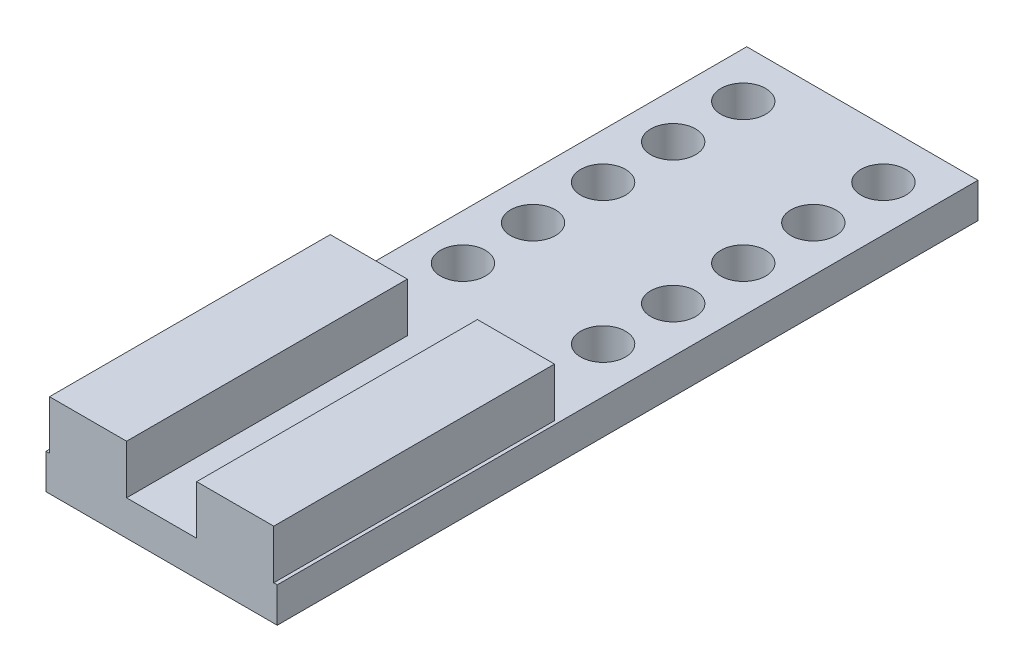
ISO-10303-21;
HEADER;
FILE_DESCRIPTION(('STEP AP214'),'2;1');
FILE_NAME('part.step','',(''),(''),'','','');
FILE_SCHEMA(('AUTOMOTIVE_DESIGN { 1 0 10303 214 1 1 1 1 }'));
ENDSEC;
DATA;
#1=APPLICATION_CONTEXT('core data for automotive mechanical design processes');
#2=APPLICATION_PROTOCOL_DEFINITION('international standard','automotive_design',2000,#1);
#3=PRODUCT_CONTEXT('',#1,'mechanical');
#4=PRODUCT('Part','Part','',(#3));
#5=PRODUCT_RELATED_PRODUCT_CATEGORY('part','',(#4));
#6=PRODUCT_DEFINITION_FORMATION('','',#4);
#7=PRODUCT_DEFINITION_CONTEXT('part definition',#1,'design');
#8=PRODUCT_DEFINITION('design','',#6,#7);
#9=PRODUCT_DEFINITION_SHAPE('','',#8);
#10=(LENGTH_UNIT() NAMED_UNIT(*) SI_UNIT(.MILLI.,.METRE.));
#11=(NAMED_UNIT(*) PLANE_ANGLE_UNIT() SI_UNIT($,.RADIAN.));
#12=(NAMED_UNIT(*) SI_UNIT($,.STERADIAN.) SOLID_ANGLE_UNIT());
#13=UNCERTAINTY_MEASURE_WITH_UNIT(LENGTH_MEASURE(1.E-05),#10,'distance_accuracy_value','');
#14=(GEOMETRIC_REPRESENTATION_CONTEXT(3) GLOBAL_UNCERTAINTY_ASSIGNED_CONTEXT((#13)) GLOBAL_UNIT_ASSIGNED_CONTEXT((#10,
#11,#12)) REPRESENTATION_CONTEXT('',''));
#15=CARTESIAN_POINT('',(0.,0.,0.));
#16=DIRECTION('',(0.,0.,1.));
#17=DIRECTION('',(1.,0.,0.));
#18=AXIS2_PLACEMENT_3D('',#15,#16,#17);
#19=CARTESIAN_POINT('',(5.,-2.5,-1.5));
#20=DIRECTION('',(0.,1.,0.));
#21=DIRECTION('',(0.,0.,1.));
#22=AXIS2_PLACEMENT_3D('',#19,#20,#21);
#23=CYLINDRICAL_SURFACE('',#22,1.6);
#24=CARTESIAN_POINT('',(5.,-2.5,-1.5));
#25=DIRECTION('',(0.,1.,0.));
#26=DIRECTION('',(0.,0.,-1.));
#27=AXIS2_PLACEMENT_3D('',#24,#25,#26);
#28=CIRCLE('',#27,1.6);
#29=CARTESIAN_POINT('',(5.,-2.5,-3.1));
#30=VERTEX_POINT('',#29);
#31=EDGE_CURVE('E42',#30,#30,#28,.T.);
#32=ORIENTED_EDGE('',*,*,#31,.F.);
#33=EDGE_LOOP('',(#32));
#34=FACE_BOUND('',#33,.T.);
#35=CARTESIAN_POINT('',(5.,0.,-1.5));
#36=DIRECTION('',(0.,1.,0.));
#37=DIRECTION('',(0.,0.,-1.));
#38=AXIS2_PLACEMENT_3D('',#35,#36,#37);
#39=CIRCLE('',#38,1.6);
#40=CARTESIAN_POINT('',(5.,0.,-3.1));
#41=VERTEX_POINT('',#40);
#42=EDGE_CURVE('E11',#41,#41,#39,.T.);
#43=ORIENTED_EDGE('',*,*,#42,.T.);
#44=EDGE_LOOP('',(#43));
#45=FACE_BOUND('',#44,.T.);
#46=ADVANCED_FACE('F35',(#34,#45),#23,.F.);
#47=CARTESIAN_POINT('',(5.,-2.5,-6.5));
#48=DIRECTION('',(0.,1.,0.));
#49=DIRECTION('',(0.,0.,1.));
#50=AXIS2_PLACEMENT_3D('',#47,#48,#49);
#51=CYLINDRICAL_SURFACE('',#50,1.6);
#52=CARTESIAN_POINT('',(5.,-2.5,-6.5));
#53=DIRECTION('',(0.,1.,0.));
#54=DIRECTION('',(0.,0.,-1.));
#55=AXIS2_PLACEMENT_3D('',#52,#53,#54);
#56=CIRCLE('',#55,1.6);
#57=CARTESIAN_POINT('',(5.,-2.5,-8.1));
#58=VERTEX_POINT('',#57);
#59=EDGE_CURVE('E239',#58,#58,#56,.T.);
#60=ORIENTED_EDGE('',*,*,#59,.F.);
#61=EDGE_LOOP('',(#60));
#62=FACE_BOUND('',#61,.T.);
#63=CARTESIAN_POINT('',(5.,0.,-6.5));
#64=DIRECTION('',(0.,1.,0.));
#65=DIRECTION('',(0.,0.,-1.));
#66=AXIS2_PLACEMENT_3D('',#63,#64,#65);
#67=CIRCLE('',#66,1.6);
#68=CARTESIAN_POINT('',(5.,0.,-8.1));
#69=VERTEX_POINT('',#68);
#70=EDGE_CURVE('E242',#69,#69,#67,.T.);
#71=ORIENTED_EDGE('',*,*,#70,.T.);
#72=EDGE_LOOP('',(#71));
#73=FACE_BOUND('',#72,.T.);
#74=ADVANCED_FACE('F251',(#62,#73),#51,.F.);
#75=CARTESIAN_POINT('',(5.,-2.5,-11.5));
#76=DIRECTION('',(0.,1.,0.));
#77=DIRECTION('',(0.,0.,1.));
#78=AXIS2_PLACEMENT_3D('',#75,#76,#77);
#79=CYLINDRICAL_SURFACE('',#78,1.6);
#80=CARTESIAN_POINT('',(5.,-2.5,-11.5));
#81=DIRECTION('',(0.,1.,0.));
#82=DIRECTION('',(0.,0.,-1.));
#83=AXIS2_PLACEMENT_3D('',#80,#81,#82);
#84=CIRCLE('',#83,1.6);
#85=CARTESIAN_POINT('',(5.,-2.5,-13.1));
#86=VERTEX_POINT('',#85);
#87=EDGE_CURVE('E233',#86,#86,#84,.T.);
#88=ORIENTED_EDGE('',*,*,#87,.F.);
#89=EDGE_LOOP('',(#88));
#90=FACE_BOUND('',#89,.T.);
#91=CARTESIAN_POINT('',(5.,0.,-11.5));
#92=DIRECTION('',(0.,1.,0.));
#93=DIRECTION('',(0.,0.,-1.));
#94=AXIS2_PLACEMENT_3D('',#91,#92,#93);
#95=CIRCLE('',#94,1.6);
#96=CARTESIAN_POINT('',(5.,0.,-13.1));
#97=VERTEX_POINT('',#96);
#98=EDGE_CURVE('E236',#97,#97,#95,.T.);
#99=ORIENTED_EDGE('',*,*,#98,.T.);
#100=EDGE_LOOP('',(#99));
#101=FACE_BOUND('',#100,.T.);
#102=ADVANCED_FACE('F290',(#90,#101),#79,.F.);
#103=CARTESIAN_POINT('',(-5.,-2.5,-1.5));
#104=DIRECTION('',(0.,1.,0.));
#105=DIRECTION('',(0.,0.,1.));
#106=AXIS2_PLACEMENT_3D('',#103,#104,#105);
#107=CYLINDRICAL_SURFACE('',#106,1.6);
#108=CARTESIAN_POINT('',(-5.,-2.5,-1.5));
#109=DIRECTION('',(0.,1.,0.));
#110=DIRECTION('',(0.,0.,1.));
#111=AXIS2_PLACEMENT_3D('',#108,#109,#110);
#112=CIRCLE('',#111,1.6);
#113=CARTESIAN_POINT('',(-5.,-2.5,0.0999999999999987));
#114=VERTEX_POINT('',#113);
#115=EDGE_CURVE('E227',#114,#114,#112,.T.);
#116=ORIENTED_EDGE('',*,*,#115,.F.);
#117=EDGE_LOOP('',(#116));
#118=FACE_BOUND('',#117,.T.);
#119=CARTESIAN_POINT('',(-5.,0.,-1.5));
#120=DIRECTION('',(0.,1.,0.));
#121=DIRECTION('',(0.,0.,1.));
#122=AXIS2_PLACEMENT_3D('',#119,#120,#121);
#123=CIRCLE('',#122,1.6);
#124=CARTESIAN_POINT('',(-5.,0.,0.0999999999999987));
#125=VERTEX_POINT('',#124);
#126=EDGE_CURVE('E230',#125,#125,#123,.T.);
#127=ORIENTED_EDGE('',*,*,#126,.T.);
#128=EDGE_LOOP('',(#127));
#129=FACE_BOUND('',#128,.T.);
#130=ADVANCED_FACE('F286',(#118,#129),#107,.F.);
#131=CARTESIAN_POINT('',(-5.,-2.5,-6.5));
#132=DIRECTION('',(0.,1.,0.));
#133=DIRECTION('',(0.,0.,1.));
#134=AXIS2_PLACEMENT_3D('',#131,#132,#133);
#135=CYLINDRICAL_SURFACE('',#134,1.6);
#136=CARTESIAN_POINT('',(-5.,-2.5,-6.5));
#137=DIRECTION('',(0.,1.,0.));
#138=DIRECTION('',(0.,0.,1.));
#139=AXIS2_PLACEMENT_3D('',#136,#137,#138);
#140=CIRCLE('',#139,1.6);
#141=CARTESIAN_POINT('',(-5.,-2.5,-4.9));
#142=VERTEX_POINT('',#141);
#143=EDGE_CURVE('E221',#142,#142,#140,.T.);
#144=ORIENTED_EDGE('',*,*,#143,.F.);
#145=EDGE_LOOP('',(#144));
#146=FACE_BOUND('',#145,.T.);
#147=CARTESIAN_POINT('',(-5.,0.,-6.5));
#148=DIRECTION('',(0.,1.,0.));
#149=DIRECTION('',(0.,0.,1.));
#150=AXIS2_PLACEMENT_3D('',#147,#148,#149);
#151=CIRCLE('',#150,1.6);
#152=CARTESIAN_POINT('',(-5.,0.,-4.9));
#153=VERTEX_POINT('',#152);
#154=EDGE_CURVE('E224',#153,#153,#151,.T.);
#155=ORIENTED_EDGE('',*,*,#154,.T.);
#156=EDGE_LOOP('',(#155));
#157=FACE_BOUND('',#156,.T.);
#158=ADVANCED_FACE('F267',(#146,#157),#135,.F.);
#159=CARTESIAN_POINT('',(-5.,-2.5,-11.5));
#160=DIRECTION('',(0.,1.,0.));
#161=DIRECTION('',(0.,0.,1.));
#162=AXIS2_PLACEMENT_3D('',#159,#160,#161);
#163=CYLINDRICAL_SURFACE('',#162,1.6);
#164=CARTESIAN_POINT('',(-5.,-2.5,-11.5));
#165=DIRECTION('',(0.,1.,0.));
#166=DIRECTION('',(0.,0.,1.));
#167=AXIS2_PLACEMENT_3D('',#164,#165,#166);
#168=CIRCLE('',#167,1.6);
#169=CARTESIAN_POINT('',(-5.,-2.5,-9.9));
#170=VERTEX_POINT('',#169);
#171=EDGE_CURVE('E209',#170,#170,#168,.T.);
#172=ORIENTED_EDGE('',*,*,#171,.F.);
#173=EDGE_LOOP('',(#172));
#174=FACE_BOUND('',#173,.T.);
#175=CARTESIAN_POINT('',(-5.,0.,-11.5));
#176=DIRECTION('',(0.,1.,0.));
#177=DIRECTION('',(0.,0.,1.));
#178=AXIS2_PLACEMENT_3D('',#175,#176,#177);
#179=CIRCLE('',#178,1.6);
#180=CARTESIAN_POINT('',(-5.,0.,-9.9));
#181=VERTEX_POINT('',#180);
#182=EDGE_CURVE('E218',#181,#181,#179,.T.);
#183=ORIENTED_EDGE('',*,*,#182,.T.);
#184=EDGE_LOOP('',(#183));
#185=FACE_BOUND('',#184,.T.);
#186=ADVANCED_FACE('F257',(#174,#185),#163,.F.);
#187=CARTESIAN_POINT('',(0.,0.,0.));
#188=DIRECTION('',(0.,1.,0.));
#189=DIRECTION('',(0.,0.,1.));
#190=AXIS2_PLACEMENT_3D('',#187,#188,#189);
#191=PLANE('',#190);
#192=CARTESIAN_POINT('',(5.,0.,-16.5));
#193=DIRECTION('',(0.,1.,0.));
#194=DIRECTION('',(0.,0.,-1.));
#195=AXIS2_PLACEMENT_3D('',#192,#193,#194);
#196=CIRCLE('',#195,1.6);
#197=CARTESIAN_POINT('',(5.,0.,-18.1));
#198=VERTEX_POINT('',#197);
#199=EDGE_CURVE('E408',#198,#198,#196,.T.);
#200=ORIENTED_EDGE('',*,*,#199,.F.);
#201=EDGE_LOOP('',(#200));
#202=FACE_BOUND('',#201,.T.);
#203=CARTESIAN_POINT('',(-5.,0.,-16.5));
#204=DIRECTION('',(0.,1.,0.));
#205=DIRECTION('',(0.,0.,1.));
#206=AXIS2_PLACEMENT_3D('',#203,#204,#205);
#207=CIRCLE('',#206,1.6);
#208=CARTESIAN_POINT('',(-5.,0.,-14.9));
#209=VERTEX_POINT('',#208);
#210=EDGE_CURVE('E410',#209,#209,#207,.T.);
#211=ORIENTED_EDGE('',*,*,#210,.F.);
#212=EDGE_LOOP('',(#211));
#213=FACE_BOUND('',#212,.T.);
#214=CARTESIAN_POINT('',(-5.,0.,-21.5));
#215=DIRECTION('',(0.,1.,0.));
#216=DIRECTION('',(0.,0.,1.));
#217=AXIS2_PLACEMENT_3D('',#214,#215,#216);
#218=CIRCLE('',#217,1.6);
#219=CARTESIAN_POINT('',(-5.,0.,-19.9));
#220=VERTEX_POINT('',#219);
#221=EDGE_CURVE('E418',#220,#220,#218,.T.);
#222=ORIENTED_EDGE('',*,*,#221,.F.);
#223=EDGE_LOOP('',(#222));
#224=FACE_BOUND('',#223,.T.);
#225=CARTESIAN_POINT('',(5.,0.,-21.5));
#226=DIRECTION('',(0.,1.,0.));
#227=DIRECTION('',(0.,0.,-1.));
#228=AXIS2_PLACEMENT_3D('',#225,#226,#227);
#229=CIRCLE('',#228,1.6);
#230=CARTESIAN_POINT('',(5.,0.,-23.1));
#231=VERTEX_POINT('',#230);
#232=EDGE_CURVE('E416',#231,#231,#229,.T.);
#233=ORIENTED_EDGE('',*,*,#232,.F.);
#234=EDGE_LOOP('',(#233));
#235=FACE_BOUND('',#234,.T.);
#236=DIRECTION('',(1.,0.,0.));
#237=VECTOR('',#236,1.);
#238=CARTESIAN_POINT('',(-8.25,0.,25.));
#239=LINE('',#238,#237);
#240=CARTESIAN_POINT('',(-2.5,0.,25.));
#241=VERTEX_POINT('',#240);
#242=CARTESIAN_POINT('',(2.5,0.,25.));
#243=VERTEX_POINT('',#242);
#244=EDGE_CURVE('E202',#241,#243,#239,.T.);
#245=ORIENTED_EDGE('',*,*,#244,.T.);
#246=DIRECTION('',(0.,0.,1.));
#247=VECTOR('',#246,1.);
#248=CARTESIAN_POINT('',(2.5,0.,25.));
#249=LINE('',#248,#247);
#250=CARTESIAN_POINT('',(2.5,0.,4.96735752453774));
#251=VERTEX_POINT('',#250);
#252=EDGE_CURVE('E148',#251,#243,#249,.T.);
#253=ORIENTED_EDGE('',*,*,#252,.F.);
#254=DIRECTION('',(-1.,0.,0.));
#255=VECTOR('',#254,1.);
#256=CARTESIAN_POINT('',(2.5,0.,4.96735752453774));
#257=LINE('',#256,#255);
#258=CARTESIAN_POINT('',(8.,0.,4.96735752453774));
#259=VERTEX_POINT('',#258);
#260=EDGE_CURVE('E144',#259,#251,#257,.T.);
#261=ORIENTED_EDGE('',*,*,#260,.F.);
#262=DIRECTION('',(0.,0.,-1.));
#263=VECTOR('',#262,1.);
#264=CARTESIAN_POINT('',(8.,0.,4.96735752453774));
#265=LINE('',#264,#263);
#266=CARTESIAN_POINT('',(8.,0.,25.));
#267=VERTEX_POINT('',#266);
#268=EDGE_CURVE('E356',#267,#259,#265,.T.);
#269=ORIENTED_EDGE('',*,*,#268,.F.);
#270=CARTESIAN_POINT('',(8.25,0.,25.));
#271=VERTEX_POINT('',#270);
#272=EDGE_CURVE('E198',#267,#271,#239,.T.);
#273=ORIENTED_EDGE('',*,*,#272,.T.);
#274=DIRECTION('',(0.,0.,-1.));
#275=VECTOR('',#274,1.);
#276=CARTESIAN_POINT('',(8.25,0.,-25.));
#277=LINE('',#276,#275);
#278=CARTESIAN_POINT('',(8.25,0.,-25.));
#279=VERTEX_POINT('',#278);
#280=EDGE_CURVE('E201',#271,#279,#277,.T.);
#281=ORIENTED_EDGE('',*,*,#280,.T.);
#282=DIRECTION('',(-1.,0.,0.));
#283=VECTOR('',#282,1.);
#284=CARTESIAN_POINT('',(-8.25,0.,-25.));
#285=LINE('',#284,#283);
#286=CARTESIAN_POINT('',(-8.25,0.,-25.));
#287=VERTEX_POINT('',#286);
#288=EDGE_CURVE('E186',#279,#287,#285,.T.);
#289=ORIENTED_EDGE('',*,*,#288,.T.);
#290=DIRECTION('',(0.,0.,1.));
#291=VECTOR('',#290,1.);
#292=CARTESIAN_POINT('',(-8.25,0.,-25.));
#293=LINE('',#292,#291);
#294=CARTESIAN_POINT('',(-8.25,0.,25.));
#295=VERTEX_POINT('',#294);
#296=EDGE_CURVE('E181',#287,#295,#293,.T.);
#297=ORIENTED_EDGE('',*,*,#296,.T.);
#298=CARTESIAN_POINT('',(-8.,0.,25.));
#299=VERTEX_POINT('',#298);
#300=EDGE_CURVE('E199',#295,#299,#239,.T.);
#301=ORIENTED_EDGE('',*,*,#300,.T.);
#302=DIRECTION('',(0.,0.,1.));
#303=VECTOR('',#302,1.);
#304=CARTESIAN_POINT('',(-8.,0.,25.));
#305=LINE('',#304,#303);
#306=CARTESIAN_POINT('',(-8.,0.,4.96735752453774));
#307=VERTEX_POINT('',#306);
#308=EDGE_CURVE('E57',#307,#299,#305,.T.);
#309=ORIENTED_EDGE('',*,*,#308,.F.);
#310=DIRECTION('',(-1.,0.,0.));
#311=VECTOR('',#310,1.);
#312=CARTESIAN_POINT('',(-8.,0.,4.96735752453774));
#313=LINE('',#312,#311);
#314=CARTESIAN_POINT('',(-2.5,0.,4.96735752453774));
#315=VERTEX_POINT('',#314);
#316=EDGE_CURVE('E160',#315,#307,#313,.T.);
#317=ORIENTED_EDGE('',*,*,#316,.F.);
#318=DIRECTION('',(0.,0.,-1.));
#319=VECTOR('',#318,1.);
#320=CARTESIAN_POINT('',(-2.5,0.,4.96735752453774));
#321=LINE('',#320,#319);
#322=EDGE_CURVE('E151',#241,#315,#321,.T.);
#323=ORIENTED_EDGE('',*,*,#322,.F.);
#324=EDGE_LOOP('',(#245,#253,#261,#269,#273,#281,#289,#297,#301,#309,#317,#323));
#325=FACE_BOUND('',#324,.T.);
#326=ORIENTED_EDGE('',*,*,#182,.F.);
#327=EDGE_LOOP('',(#326));
#328=FACE_BOUND('',#327,.T.);
#329=ORIENTED_EDGE('',*,*,#154,.F.);
#330=EDGE_LOOP('',(#329));
#331=FACE_BOUND('',#330,.T.);
#332=ORIENTED_EDGE('',*,*,#126,.F.);
#333=EDGE_LOOP('',(#332));
#334=FACE_BOUND('',#333,.T.);
#335=ORIENTED_EDGE('',*,*,#98,.F.);
#336=EDGE_LOOP('',(#335));
#337=FACE_BOUND('',#336,.T.);
#338=ORIENTED_EDGE('',*,*,#70,.F.);
#339=EDGE_LOOP('',(#338));
#340=FACE_BOUND('',#339,.T.);
#341=ORIENTED_EDGE('',*,*,#42,.F.);
#342=EDGE_LOOP('',(#341));
#343=FACE_BOUND('',#342,.T.);
#344=ADVANCED_FACE('F254',(#202,#213,#224,#235,#325,#328,#331,#334,#337,#340,#343),#191,.T.);
#345=CARTESIAN_POINT('',(-8.25,-2.5,-25.));
#346=DIRECTION('',(-1.,0.,0.));
#347=DIRECTION('',(0.,0.,1.));
#348=AXIS2_PLACEMENT_3D('',#345,#346,#347);
#349=PLANE('',#348);
#350=ORIENTED_EDGE('',*,*,#296,.F.);
#351=DIRECTION('',(0.,1.,0.));
#352=VECTOR('',#351,1.);
#353=CARTESIAN_POINT('',(-8.25,-2.5,-25.));
#354=LINE('',#353,#352);
#355=CARTESIAN_POINT('',(-8.25,-2.5,-25.));
#356=VERTEX_POINT('',#355);
#357=EDGE_CURVE('E207',#356,#287,#354,.T.);
#358=ORIENTED_EDGE('',*,*,#357,.F.);
#359=DIRECTION('',(0.,0.,1.));
#360=VECTOR('',#359,1.);
#361=CARTESIAN_POINT('',(-8.25,-2.5,-25.));
#362=LINE('',#361,#360);
#363=CARTESIAN_POINT('',(-8.25,-2.5,25.));
#364=VERTEX_POINT('',#363);
#365=EDGE_CURVE('E182',#356,#364,#362,.T.);
#366=ORIENTED_EDGE('',*,*,#365,.T.);
#367=DIRECTION('',(0.,1.,0.));
#368=VECTOR('',#367,1.);
#369=CARTESIAN_POINT('',(-8.25,-2.5,25.));
#370=LINE('',#369,#368);
#371=EDGE_CURVE('E195',#364,#295,#370,.T.);
#372=ORIENTED_EDGE('',*,*,#371,.T.);
#373=EDGE_LOOP('',(#350,#358,#366,#372));
#374=FACE_BOUND('',#373,.T.);
#375=ADVANCED_FACE('F256',(#374),#349,.T.);
#376=CARTESIAN_POINT('',(-8.25,-2.5,-25.));
#377=DIRECTION('',(0.,0.,-1.));
#378=DIRECTION('',(-1.,0.,0.));
#379=AXIS2_PLACEMENT_3D('',#376,#377,#378);
#380=PLANE('',#379);
#381=ORIENTED_EDGE('',*,*,#288,.F.);
#382=DIRECTION('',(0.,1.,0.));
#383=VECTOR('',#382,1.);
#384=CARTESIAN_POINT('',(8.25,-2.5,-25.));
#385=LINE('',#384,#383);
#386=CARTESIAN_POINT('',(8.25,-2.5,-25.));
#387=VERTEX_POINT('',#386);
#388=EDGE_CURVE('E210',#387,#279,#385,.T.);
#389=ORIENTED_EDGE('',*,*,#388,.F.);
#390=DIRECTION('',(-1.,0.,0.));
#391=VECTOR('',#390,1.);
#392=CARTESIAN_POINT('',(-8.25,-2.5,-25.));
#393=LINE('',#392,#391);
#394=EDGE_CURVE('E192',#387,#356,#393,.T.);
#395=ORIENTED_EDGE('',*,*,#394,.T.);
#396=ORIENTED_EDGE('',*,*,#357,.T.);
#397=EDGE_LOOP('',(#381,#389,#395,#396));
#398=FACE_BOUND('',#397,.T.);
#399=ADVANCED_FACE('F264',(#398),#380,.T.);
#400=CARTESIAN_POINT('',(8.25,-2.5,-25.));
#401=DIRECTION('',(1.,0.,0.));
#402=DIRECTION('',(0.,0.,-1.));
#403=AXIS2_PLACEMENT_3D('',#400,#401,#402);
#404=PLANE('',#403);
#405=ORIENTED_EDGE('',*,*,#280,.F.);
#406=DIRECTION('',(0.,1.,0.));
#407=VECTOR('',#406,1.);
#408=CARTESIAN_POINT('',(8.25,-2.5,25.));
#409=LINE('',#408,#407);
#410=CARTESIAN_POINT('',(8.25,-2.5,25.));
#411=VERTEX_POINT('',#410);
#412=EDGE_CURVE('E212',#411,#271,#409,.T.);
#413=ORIENTED_EDGE('',*,*,#412,.F.);
#414=DIRECTION('',(0.,0.,-1.));
#415=VECTOR('',#414,1.);
#416=CARTESIAN_POINT('',(8.25,-2.5,-25.));
#417=LINE('',#416,#415);
#418=EDGE_CURVE('E189',#411,#387,#417,.T.);
#419=ORIENTED_EDGE('',*,*,#418,.T.);
#420=ORIENTED_EDGE('',*,*,#388,.T.);
#421=EDGE_LOOP('',(#405,#413,#419,#420));
#422=FACE_BOUND('',#421,.T.);
#423=ADVANCED_FACE('F277',(#422),#404,.T.);
#424=CARTESIAN_POINT('',(-8.25,-2.5,25.));
#425=DIRECTION('',(0.,0.,1.));
#426=DIRECTION('',(1.,0.,0.));
#427=AXIS2_PLACEMENT_3D('',#424,#425,#426);
#428=PLANE('',#427);
#429=ORIENTED_EDGE('',*,*,#300,.F.);
#430=ORIENTED_EDGE('',*,*,#371,.F.);
#431=DIRECTION('',(1.,0.,0.));
#432=VECTOR('',#431,1.);
#433=CARTESIAN_POINT('',(-8.25,-2.5,25.));
#434=LINE('',#433,#432);
#435=EDGE_CURVE('E185',#364,#411,#434,.T.);
#436=ORIENTED_EDGE('',*,*,#435,.T.);
#437=ORIENTED_EDGE('',*,*,#412,.T.);
#438=ORIENTED_EDGE('',*,*,#272,.F.);
#439=DIRECTION('',(0.,-1.,0.));
#440=VECTOR('',#439,1.);
#441=CARTESIAN_POINT('',(8.,3.5,25.));
#442=LINE('',#441,#440);
#443=CARTESIAN_POINT('',(8.,3.5,25.));
#444=VERTEX_POINT('',#443);
#445=EDGE_CURVE('E132',#444,#267,#442,.T.);
#446=ORIENTED_EDGE('',*,*,#445,.F.);
#447=DIRECTION('',(1.,0.,0.));
#448=VECTOR('',#447,1.);
#449=CARTESIAN_POINT('',(8.,3.5,25.));
#450=LINE('',#449,#448);
#451=CARTESIAN_POINT('',(2.5,3.5,25.));
#452=VERTEX_POINT('',#451);
#453=EDGE_CURVE('E123',#452,#444,#450,.T.);
#454=ORIENTED_EDGE('',*,*,#453,.F.);
#455=DIRECTION('',(0.,-1.,0.));
#456=VECTOR('',#455,1.);
#457=CARTESIAN_POINT('',(2.5,3.5,25.));
#458=LINE('',#457,#456);
#459=EDGE_CURVE('E129',#452,#243,#458,.T.);
#460=ORIENTED_EDGE('',*,*,#459,.T.);
#461=ORIENTED_EDGE('',*,*,#244,.F.);
#462=DIRECTION('',(0.,-1.,0.));
#463=VECTOR('',#462,1.);
#464=CARTESIAN_POINT('',(-2.5,3.5,25.));
#465=LINE('',#464,#463);
#466=CARTESIAN_POINT('',(-2.5,3.5,25.));
#467=VERTEX_POINT('',#466);
#468=EDGE_CURVE('E175',#467,#241,#465,.T.);
#469=ORIENTED_EDGE('',*,*,#468,.F.);
#470=DIRECTION('',(1.,0.,0.));
#471=VECTOR('',#470,1.);
#472=CARTESIAN_POINT('',(-2.5,3.5,25.));
#473=LINE('',#472,#471);
#474=CARTESIAN_POINT('',(-8.,3.5,25.));
#475=VERTEX_POINT('',#474);
#476=EDGE_CURVE('E159',#475,#467,#473,.T.);
#477=ORIENTED_EDGE('',*,*,#476,.F.);
#478=DIRECTION('',(0.,-1.,0.));
#479=VECTOR('',#478,1.);
#480=CARTESIAN_POINT('',(-8.,3.5,25.));
#481=LINE('',#480,#479);
#482=EDGE_CURVE('E178',#475,#299,#481,.T.);
#483=ORIENTED_EDGE('',*,*,#482,.T.);
#484=EDGE_LOOP('',(#429,#430,#436,#437,#438,#446,#454,#460,#461,#469,#477,#483));
#485=FACE_BOUND('',#484,.T.);
#486=ADVANCED_FACE('F126',(#485),#428,.T.);
#487=CARTESIAN_POINT('',(0.,-2.5,0.));
#488=DIRECTION('',(0.,1.,0.));
#489=DIRECTION('',(0.,0.,1.));
#490=AXIS2_PLACEMENT_3D('',#487,#488,#489);
#491=PLANE('',#490);
#492=CARTESIAN_POINT('',(5.,-2.5,-16.5));
#493=DIRECTION('',(0.,1.,0.));
#494=DIRECTION('',(0.,0.,-1.));
#495=AXIS2_PLACEMENT_3D('',#492,#493,#494);
#496=CIRCLE('',#495,1.6);
#497=CARTESIAN_POINT('',(5.,-2.5,-18.1));
#498=VERTEX_POINT('',#497);
#499=EDGE_CURVE('E314',#498,#498,#496,.T.);
#500=ORIENTED_EDGE('',*,*,#499,.T.);
#501=EDGE_LOOP('',(#500));
#502=FACE_BOUND('',#501,.T.);
#503=CARTESIAN_POINT('',(-5.,-2.5,-16.5));
#504=DIRECTION('',(0.,1.,0.));
#505=DIRECTION('',(0.,0.,1.));
#506=AXIS2_PLACEMENT_3D('',#503,#504,#505);
#507=CIRCLE('',#506,1.6);
#508=CARTESIAN_POINT('',(-5.,-2.5,-14.9));
#509=VERTEX_POINT('',#508);
#510=EDGE_CURVE('E318',#509,#509,#507,.T.);
#511=ORIENTED_EDGE('',*,*,#510,.T.);
#512=EDGE_LOOP('',(#511));
#513=FACE_BOUND('',#512,.T.);
#514=CARTESIAN_POINT('',(-5.,-2.5,-21.5));
#515=DIRECTION('',(0.,1.,0.));
#516=DIRECTION('',(0.,0.,1.));
#517=AXIS2_PLACEMENT_3D('',#514,#515,#516);
#518=CIRCLE('',#517,1.6);
#519=CARTESIAN_POINT('',(-5.,-2.5,-19.9));
#520=VERTEX_POINT('',#519);
#521=EDGE_CURVE('E322',#520,#520,#518,.T.);
#522=ORIENTED_EDGE('',*,*,#521,.T.);
#523=EDGE_LOOP('',(#522));
#524=FACE_BOUND('',#523,.T.);
#525=CARTESIAN_POINT('',(5.,-2.5,-21.5));
#526=DIRECTION('',(0.,1.,0.));
#527=DIRECTION('',(0.,0.,-1.));
#528=AXIS2_PLACEMENT_3D('',#525,#526,#527);
#529=CIRCLE('',#528,1.6);
#530=CARTESIAN_POINT('',(5.,-2.5,-23.1));
#531=VERTEX_POINT('',#530);
#532=EDGE_CURVE('E326',#531,#531,#529,.T.);
#533=ORIENTED_EDGE('',*,*,#532,.T.);
#534=EDGE_LOOP('',(#533));
#535=FACE_BOUND('',#534,.T.);
#536=ORIENTED_EDGE('',*,*,#365,.F.);
#537=ORIENTED_EDGE('',*,*,#394,.F.);
#538=ORIENTED_EDGE('',*,*,#418,.F.);
#539=ORIENTED_EDGE('',*,*,#435,.F.);
#540=EDGE_LOOP('',(#536,#537,#538,#539));
#541=FACE_BOUND('',#540,.T.);
#542=ORIENTED_EDGE('',*,*,#171,.T.);
#543=EDGE_LOOP('',(#542));
#544=FACE_BOUND('',#543,.T.);
#545=ORIENTED_EDGE('',*,*,#143,.T.);
#546=EDGE_LOOP('',(#545));
#547=FACE_BOUND('',#546,.T.);
#548=ORIENTED_EDGE('',*,*,#115,.T.);
#549=EDGE_LOOP('',(#548));
#550=FACE_BOUND('',#549,.T.);
#551=ORIENTED_EDGE('',*,*,#87,.T.);
#552=EDGE_LOOP('',(#551));
#553=FACE_BOUND('',#552,.T.);
#554=ORIENTED_EDGE('',*,*,#59,.T.);
#555=EDGE_LOOP('',(#554));
#556=FACE_BOUND('',#555,.T.);
#557=ORIENTED_EDGE('',*,*,#31,.T.);
#558=EDGE_LOOP('',(#557));
#559=FACE_BOUND('',#558,.T.);
#560=ADVANCED_FACE('F247',(#502,#513,#524,#535,#541,#544,#547,#550,#553,#556,#559),#491,.F.);
#561=CARTESIAN_POINT('',(-8.,3.5,25.));
#562=DIRECTION('',(1.,0.,0.));
#563=DIRECTION('',(0.,0.,-1.));
#564=AXIS2_PLACEMENT_3D('',#561,#562,#563);
#565=PLANE('',#564);
#566=ORIENTED_EDGE('',*,*,#308,.T.);
#567=ORIENTED_EDGE('',*,*,#482,.F.);
#568=DIRECTION('',(0.,0.,1.));
#569=VECTOR('',#568,1.);
#570=CARTESIAN_POINT('',(-8.,3.5,25.));
#571=LINE('',#570,#569);
#572=CARTESIAN_POINT('',(-8.,3.5,4.96735752453774));
#573=VERTEX_POINT('',#572);
#574=EDGE_CURVE('E156',#573,#475,#571,.T.);
#575=ORIENTED_EDGE('',*,*,#574,.F.);
#576=DIRECTION('',(0.,-1.,0.));
#577=VECTOR('',#576,1.);
#578=CARTESIAN_POINT('',(-8.,3.5,4.96735752453774));
#579=LINE('',#578,#577);
#580=EDGE_CURVE('E165',#573,#307,#579,.T.);
#581=ORIENTED_EDGE('',*,*,#580,.T.);
#582=EDGE_LOOP('',(#566,#567,#575,#581));
#583=FACE_BOUND('',#582,.T.);
#584=ADVANCED_FACE('F304',(#583),#565,.F.);
#585=CARTESIAN_POINT('',(-2.5,3.5,4.96735752453774));
#586=DIRECTION('',(-1.,0.,0.));
#587=DIRECTION('',(0.,0.,1.));
#588=AXIS2_PLACEMENT_3D('',#585,#586,#587);
#589=PLANE('',#588);
#590=ORIENTED_EDGE('',*,*,#322,.T.);
#591=DIRECTION('',(0.,-1.,0.));
#592=VECTOR('',#591,1.);
#593=CARTESIAN_POINT('',(-2.5,3.5,4.96735752453774));
#594=LINE('',#593,#592);
#595=CARTESIAN_POINT('',(-2.5,3.5,4.96735752453774));
#596=VERTEX_POINT('',#595);
#597=EDGE_CURVE('E172',#596,#315,#594,.T.);
#598=ORIENTED_EDGE('',*,*,#597,.F.);
#599=DIRECTION('',(0.,0.,-1.));
#600=VECTOR('',#599,1.);
#601=CARTESIAN_POINT('',(-2.5,3.5,4.96735752453774));
#602=LINE('',#601,#600);
#603=EDGE_CURVE('E162',#467,#596,#602,.T.);
#604=ORIENTED_EDGE('',*,*,#603,.F.);
#605=ORIENTED_EDGE('',*,*,#468,.T.);
#606=EDGE_LOOP('',(#590,#598,#604,#605));
#607=FACE_BOUND('',#606,.T.);
#608=ADVANCED_FACE('F309',(#607),#589,.F.);
#609=CARTESIAN_POINT('',(-8.,3.5,4.96735752453774));
#610=DIRECTION('',(0.,0.,1.));
#611=DIRECTION('',(1.,0.,0.));
#612=AXIS2_PLACEMENT_3D('',#609,#610,#611);
#613=PLANE('',#612);
#614=ORIENTED_EDGE('',*,*,#316,.T.);
#615=ORIENTED_EDGE('',*,*,#580,.F.);
#616=DIRECTION('',(-1.,0.,0.));
#617=VECTOR('',#616,1.);
#618=CARTESIAN_POINT('',(-8.,3.5,4.96735752453774));
#619=LINE('',#618,#617);
#620=EDGE_CURVE('E164',#596,#573,#619,.T.);
#621=ORIENTED_EDGE('',*,*,#620,.F.);
#622=ORIENTED_EDGE('',*,*,#597,.T.);
#623=EDGE_LOOP('',(#614,#615,#621,#622));
#624=FACE_BOUND('',#623,.T.);
#625=ADVANCED_FACE('F368',(#624),#613,.F.);
#626=CARTESIAN_POINT('',(0.,3.5,0.));
#627=DIRECTION('',(0.,-1.,0.));
#628=DIRECTION('',(0.,0.,-1.));
#629=AXIS2_PLACEMENT_3D('',#626,#627,#628);
#630=PLANE('',#629);
#631=ORIENTED_EDGE('',*,*,#574,.T.);
#632=ORIENTED_EDGE('',*,*,#476,.T.);
#633=ORIENTED_EDGE('',*,*,#603,.T.);
#634=ORIENTED_EDGE('',*,*,#620,.T.);
#635=EDGE_LOOP('',(#631,#632,#633,#634));
#636=FACE_BOUND('',#635,.T.);
#637=ADVANCED_FACE('F363',(#636),#630,.F.);
#638=CARTESIAN_POINT('',(2.5,3.5,25.));
#639=DIRECTION('',(1.,0.,0.));
#640=DIRECTION('',(0.,0.,-1.));
#641=AXIS2_PLACEMENT_3D('',#638,#639,#640);
#642=PLANE('',#641);
#643=ORIENTED_EDGE('',*,*,#252,.T.);
#644=ORIENTED_EDGE('',*,*,#459,.F.);
#645=DIRECTION('',(0.,0.,1.));
#646=VECTOR('',#645,1.);
#647=CARTESIAN_POINT('',(2.5,3.5,25.));
#648=LINE('',#647,#646);
#649=CARTESIAN_POINT('',(2.5,3.5,4.96735752453774));
#650=VERTEX_POINT('',#649);
#651=EDGE_CURVE('E136',#650,#452,#648,.T.);
#652=ORIENTED_EDGE('',*,*,#651,.F.);
#653=DIRECTION('',(0.,-1.,0.));
#654=VECTOR('',#653,1.);
#655=CARTESIAN_POINT('',(2.5,3.5,4.96735752453774));
#656=LINE('',#655,#654);
#657=EDGE_CURVE('E426',#650,#251,#656,.T.);
#658=ORIENTED_EDGE('',*,*,#657,.T.);
#659=EDGE_LOOP('',(#643,#644,#652,#658));
#660=FACE_BOUND('',#659,.T.);
#661=ADVANCED_FACE('F146',(#660),#642,.F.);
#662=CARTESIAN_POINT('',(8.,3.5,4.96735752453774));
#663=DIRECTION('',(-1.,0.,0.));
#664=DIRECTION('',(0.,0.,1.));
#665=AXIS2_PLACEMENT_3D('',#662,#663,#664);
#666=PLANE('',#665);
#667=ORIENTED_EDGE('',*,*,#268,.T.);
#668=DIRECTION('',(0.,-1.,0.));
#669=VECTOR('',#668,1.);
#670=CARTESIAN_POINT('',(8.,3.5,4.96735752453774));
#671=LINE('',#670,#669);
#672=CARTESIAN_POINT('',(8.,3.5,4.96735752453774));
#673=VERTEX_POINT('',#672);
#674=EDGE_CURVE('E49',#673,#259,#671,.T.);
#675=ORIENTED_EDGE('',*,*,#674,.F.);
#676=DIRECTION('',(0.,0.,-1.));
#677=VECTOR('',#676,1.);
#678=CARTESIAN_POINT('',(8.,3.5,4.96735752453774));
#679=LINE('',#678,#677);
#680=EDGE_CURVE('E135',#444,#673,#679,.T.);
#681=ORIENTED_EDGE('',*,*,#680,.F.);
#682=ORIENTED_EDGE('',*,*,#445,.T.);
#683=EDGE_LOOP('',(#667,#675,#681,#682));
#684=FACE_BOUND('',#683,.T.);
#685=ADVANCED_FACE('F380',(#684),#666,.F.);
#686=CARTESIAN_POINT('',(2.5,3.5,4.96735752453774));
#687=DIRECTION('',(0.,0.,1.));
#688=DIRECTION('',(1.,0.,0.));
#689=AXIS2_PLACEMENT_3D('',#686,#687,#688);
#690=PLANE('',#689);
#691=ORIENTED_EDGE('',*,*,#260,.T.);
#692=ORIENTED_EDGE('',*,*,#657,.F.);
#693=DIRECTION('',(-1.,0.,0.));
#694=VECTOR('',#693,1.);
#695=CARTESIAN_POINT('',(2.5,3.5,4.96735752453774));
#696=LINE('',#695,#694);
#697=EDGE_CURVE('E140',#673,#650,#696,.T.);
#698=ORIENTED_EDGE('',*,*,#697,.F.);
#699=ORIENTED_EDGE('',*,*,#674,.T.);
#700=EDGE_LOOP('',(#691,#692,#698,#699));
#701=FACE_BOUND('',#700,.T.);
#702=ADVANCED_FACE('F383',(#701),#690,.F.);
#703=CARTESIAN_POINT('',(0.,3.5,0.));
#704=DIRECTION('',(0.,-1.,0.));
#705=DIRECTION('',(0.,0.,-1.));
#706=AXIS2_PLACEMENT_3D('',#703,#704,#705);
#707=PLANE('',#706);
#708=ORIENTED_EDGE('',*,*,#651,.T.);
#709=ORIENTED_EDGE('',*,*,#453,.T.);
#710=ORIENTED_EDGE('',*,*,#680,.T.);
#711=ORIENTED_EDGE('',*,*,#697,.T.);
#712=EDGE_LOOP('',(#708,#709,#710,#711));
#713=FACE_BOUND('',#712,.T.);
#714=ADVANCED_FACE('F139',(#713),#707,.F.);
#715=CARTESIAN_POINT('',(5.,-2.5,-21.5));
#716=DIRECTION('',(0.,1.,0.));
#717=DIRECTION('',(0.,0.,1.));
#718=AXIS2_PLACEMENT_3D('',#715,#716,#717);
#719=CYLINDRICAL_SURFACE('',#718,1.6);
#720=ORIENTED_EDGE('',*,*,#532,.F.);
#721=EDGE_LOOP('',(#720));
#722=FACE_BOUND('',#721,.T.);
#723=ORIENTED_EDGE('',*,*,#232,.T.);
#724=EDGE_LOOP('',(#723));
#725=FACE_BOUND('',#724,.T.);
#726=ADVANCED_FACE('F389',(#722,#725),#719,.F.);
#727=CARTESIAN_POINT('',(-5.,-2.5,-21.5));
#728=DIRECTION('',(0.,1.,0.));
#729=DIRECTION('',(0.,0.,1.));
#730=AXIS2_PLACEMENT_3D('',#727,#728,#729);
#731=CYLINDRICAL_SURFACE('',#730,1.6);
#732=ORIENTED_EDGE('',*,*,#521,.F.);
#733=EDGE_LOOP('',(#732));
#734=FACE_BOUND('',#733,.T.);
#735=ORIENTED_EDGE('',*,*,#221,.T.);
#736=EDGE_LOOP('',(#735));
#737=FACE_BOUND('',#736,.T.);
#738=ADVANCED_FACE('F392',(#734,#737),#731,.F.);
#739=CARTESIAN_POINT('',(-5.,-2.5,-16.5));
#740=DIRECTION('',(0.,1.,0.));
#741=DIRECTION('',(0.,0.,1.));
#742=AXIS2_PLACEMENT_3D('',#739,#740,#741);
#743=CYLINDRICAL_SURFACE('',#742,1.6);
#744=ORIENTED_EDGE('',*,*,#510,.F.);
#745=EDGE_LOOP('',(#744));
#746=FACE_BOUND('',#745,.T.);
#747=ORIENTED_EDGE('',*,*,#210,.T.);
#748=EDGE_LOOP('',(#747));
#749=FACE_BOUND('',#748,.T.);
#750=ADVANCED_FACE('F396',(#746,#749),#743,.F.);
#751=CARTESIAN_POINT('',(5.,-2.5,-16.5));
#752=DIRECTION('',(0.,1.,0.));
#753=DIRECTION('',(0.,0.,1.));
#754=AXIS2_PLACEMENT_3D('',#751,#752,#753);
#755=CYLINDRICAL_SURFACE('',#754,1.6);
#756=ORIENTED_EDGE('',*,*,#499,.F.);
#757=EDGE_LOOP('',(#756));
#758=FACE_BOUND('',#757,.T.);
#759=ORIENTED_EDGE('',*,*,#199,.T.);
#760=EDGE_LOOP('',(#759));
#761=FACE_BOUND('',#760,.T.);
#762=ADVANCED_FACE('F400',(#758,#761),#755,.F.);
#763=CLOSED_SHELL('',(#46,#74,#102,#130,#158,#186,#344,#375,#399,#423,#486,#560,#584,#608,#625,
#637,#661,#685,#702,#714,#726,#738,#750,#762));
#764=MANIFOLD_SOLID_BREP('B2',#763);
#765=ADVANCED_BREP_SHAPE_REPRESENTATION('',(#18,#764),#14);
#766=SHAPE_DEFINITION_REPRESENTATION(#9,#765);
ENDSEC;
END-ISO-10303-21;
